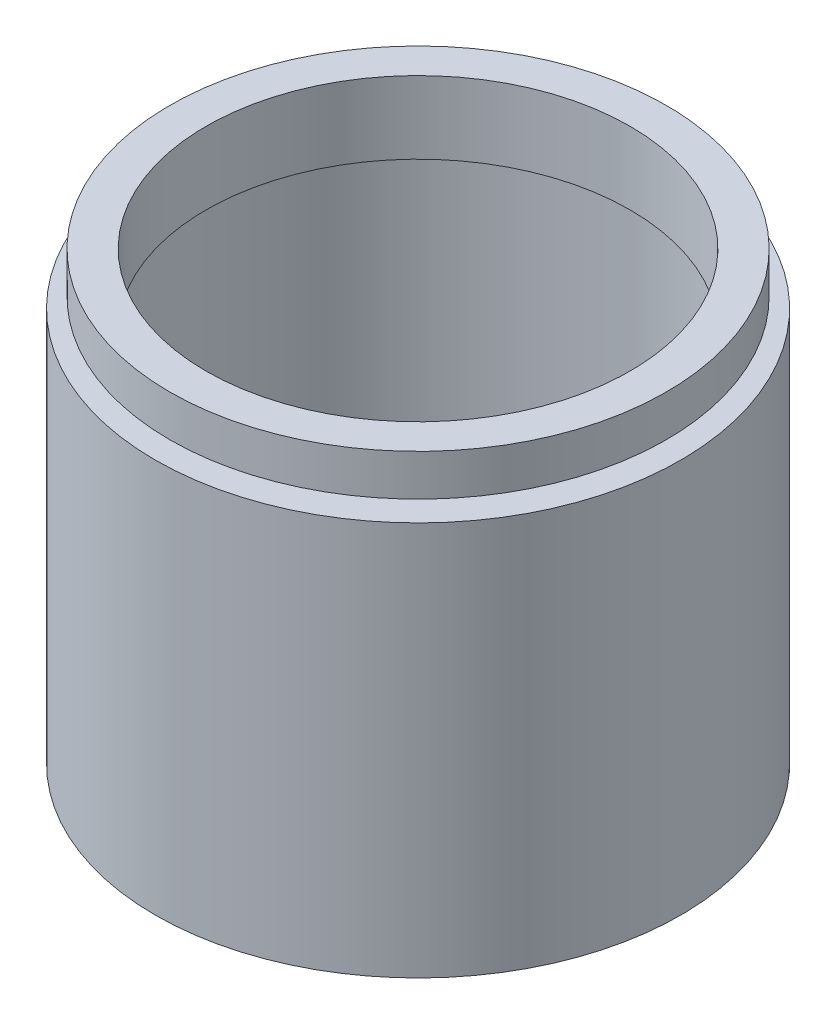
ISO-10303-21;
HEADER;
FILE_DESCRIPTION(('STEP AP214'),'2;1');
FILE_NAME('part.step','',(''),(''),'','','');
FILE_SCHEMA(('AUTOMOTIVE_DESIGN { 1 0 10303 214 1 1 1 1 }'));
ENDSEC;
DATA;
#1=APPLICATION_CONTEXT('core data for automotive mechanical design processes');
#2=APPLICATION_PROTOCOL_DEFINITION('international standard','automotive_design',2000,#1);
#3=PRODUCT_CONTEXT('',#1,'mechanical');
#4=PRODUCT('Part','Part','',(#3));
#5=PRODUCT_RELATED_PRODUCT_CATEGORY('part','',(#4));
#6=PRODUCT_DEFINITION_FORMATION('','',#4);
#7=PRODUCT_DEFINITION_CONTEXT('part definition',#1,'design');
#8=PRODUCT_DEFINITION('design','',#6,#7);
#9=PRODUCT_DEFINITION_SHAPE('','',#8);
#10=(LENGTH_UNIT() NAMED_UNIT(*) SI_UNIT(.MILLI.,.METRE.));
#11=(NAMED_UNIT(*) PLANE_ANGLE_UNIT() SI_UNIT($,.RADIAN.));
#12=(NAMED_UNIT(*) SI_UNIT($,.STERADIAN.) SOLID_ANGLE_UNIT());
#13=UNCERTAINTY_MEASURE_WITH_UNIT(LENGTH_MEASURE(1.E-05),#10,'distance_accuracy_value','');
#14=(GEOMETRIC_REPRESENTATION_CONTEXT(3) GLOBAL_UNCERTAINTY_ASSIGNED_CONTEXT((#13)) GLOBAL_UNIT_ASSIGNED_CONTEXT((#10,
#11,#12)) REPRESENTATION_CONTEXT('',''));
#15=CARTESIAN_POINT('',(0.,0.,0.));
#16=DIRECTION('',(0.,0.,1.));
#17=DIRECTION('',(1.,0.,0.));
#18=AXIS2_PLACEMENT_3D('',#15,#16,#17);
#19=CARTESIAN_POINT('',(25.4,38.1,0.));
#20=DIRECTION('',(0.,-1.,0.));
#21=DIRECTION('',(0.,0.,-1.));
#22=AXIS2_PLACEMENT_3D('',#19,#20,#21);
#23=PLANE('',#22);
#24=CARTESIAN_POINT('',(0.,38.1,0.));
#25=DIRECTION('',(0.,1.,0.));
#26=DIRECTION('',(0.,0.,1.));
#27=AXIS2_PLACEMENT_3D('',#24,#25,#26);
#28=CIRCLE('',#27,22.4999999999999);
#29=CARTESIAN_POINT('',(0.,38.1,22.4999999999999));
#30=VERTEX_POINT('',#29);
#31=EDGE_CURVE('E89',#30,#30,#28,.T.);
#32=ORIENTED_EDGE('',*,*,#31,.F.);
#33=EDGE_LOOP('',(#32));
#34=FACE_BOUND('',#33,.T.);
#35=CARTESIAN_POINT('',(0.,38.1,0.));
#36=DIRECTION('',(0.,1.,0.));
#37=DIRECTION('',(0.,0.,1.));
#38=AXIS2_PLACEMENT_3D('',#35,#36,#37);
#39=CIRCLE('',#38,25.4);
#40=CARTESIAN_POINT('',(0.,38.1,25.4));
#41=VERTEX_POINT('',#40);
#42=EDGE_CURVE('E10',#41,#41,#39,.T.);
#43=ORIENTED_EDGE('',*,*,#42,.T.);
#44=EDGE_LOOP('',(#43));
#45=FACE_BOUND('',#44,.T.);
#46=ADVANCED_FACE('F37',(#34,#45),#23,.F.);
#47=CARTESIAN_POINT('',(0.,161.376166943427,0.));
#48=DIRECTION('',(0.,1.,0.));
#49=DIRECTION('',(0.,0.,1.));
#50=AXIS2_PLACEMENT_3D('',#47,#48,#49);
#51=CYLINDRICAL_SURFACE('',#50,25.4);
#52=ORIENTED_EDGE('',*,*,#42,.F.);
#53=EDGE_LOOP('',(#52));
#54=FACE_BOUND('',#53,.T.);
#55=CARTESIAN_POINT('',(0.,0.,0.));
#56=DIRECTION('',(0.,1.,0.));
#57=DIRECTION('',(0.,0.,1.));
#58=AXIS2_PLACEMENT_3D('',#55,#56,#57);
#59=CIRCLE('',#58,25.4);
#60=CARTESIAN_POINT('',(0.,0.,25.4));
#61=VERTEX_POINT('',#60);
#62=EDGE_CURVE('E43',#61,#61,#59,.T.);
#63=ORIENTED_EDGE('',*,*,#62,.T.);
#64=EDGE_LOOP('',(#63));
#65=FACE_BOUND('',#64,.T.);
#66=ADVANCED_FACE('F96',(#54,#65),#51,.T.);
#67=CARTESIAN_POINT('',(25.4,0.,0.));
#68=DIRECTION('',(0.,1.,0.));
#69=DIRECTION('',(0.,0.,1.));
#70=AXIS2_PLACEMENT_3D('',#67,#68,#69);
#71=PLANE('',#70);
#72=ORIENTED_EDGE('',*,*,#62,.F.);
#73=EDGE_LOOP('',(#72));
#74=FACE_BOUND('',#73,.T.);
#75=CARTESIAN_POINT('',(0.,0.,0.));
#76=DIRECTION('',(0.,1.,0.));
#77=DIRECTION('',(0.,0.,1.));
#78=AXIS2_PLACEMENT_3D('',#75,#76,#77);
#79=CIRCLE('',#78,22.5);
#80=CARTESIAN_POINT('',(0.,0.,22.5));
#81=VERTEX_POINT('',#80);
#82=EDGE_CURVE('E47',#81,#81,#79,.T.);
#83=ORIENTED_EDGE('',*,*,#82,.T.);
#84=EDGE_LOOP('',(#83));
#85=FACE_BOUND('',#84,.T.);
#86=ADVANCED_FACE('F100',(#74,#85),#71,.F.);
#87=CARTESIAN_POINT('',(0.,161.376166943427,0.));
#88=DIRECTION('',(0.,1.,0.));
#89=DIRECTION('',(0.,0.,1.));
#90=AXIS2_PLACEMENT_3D('',#87,#88,#89);
#91=CYLINDRICAL_SURFACE('',#90,22.5);
#92=ORIENTED_EDGE('',*,*,#82,.F.);
#93=EDGE_LOOP('',(#92));
#94=FACE_BOUND('',#93,.T.);
#95=CARTESIAN_POINT('',(0.,5.49999999999998,0.));
#96=DIRECTION('',(0.,1.,0.));
#97=DIRECTION('',(0.,0.,1.));
#98=AXIS2_PLACEMENT_3D('',#95,#96,#97);
#99=CIRCLE('',#98,22.5);
#100=CARTESIAN_POINT('',(0.,5.49999999999998,22.5));
#101=VERTEX_POINT('',#100);
#102=EDGE_CURVE('E51',#101,#101,#99,.T.);
#103=ORIENTED_EDGE('',*,*,#102,.T.);
#104=EDGE_LOOP('',(#103));
#105=FACE_BOUND('',#104,.T.);
#106=ADVANCED_FACE('F105',(#94,#105),#91,.F.);
#107=CARTESIAN_POINT('',(22.5,5.49999999999999,0.));
#108=DIRECTION('',(0.,-1.,0.));
#109=DIRECTION('',(0.,0.,-1.));
#110=AXIS2_PLACEMENT_3D('',#107,#108,#109);
#111=PLANE('',#110);
#112=ORIENTED_EDGE('',*,*,#102,.F.);
#113=EDGE_LOOP('',(#112));
#114=FACE_BOUND('',#113,.T.);
#115=CARTESIAN_POINT('',(0.,5.49999999999998,0.));
#116=DIRECTION('',(0.,1.,0.));
#117=DIRECTION('',(0.,0.,1.));
#118=AXIS2_PLACEMENT_3D('',#115,#116,#117);
#119=CIRCLE('',#118,23.4999999999999);
#120=CARTESIAN_POINT('',(0.,5.49999999999998,23.4999999999999));
#121=VERTEX_POINT('',#120);
#122=EDGE_CURVE('E56',#121,#121,#119,.T.);
#123=ORIENTED_EDGE('',*,*,#122,.T.);
#124=EDGE_LOOP('',(#123));
#125=FACE_BOUND('',#124,.T.);
#126=ADVANCED_FACE('F111',(#114,#125),#111,.F.);
#127=CARTESIAN_POINT('',(0.,161.376166943427,0.));
#128=DIRECTION('',(0.,1.,0.));
#129=DIRECTION('',(0.,0.,1.));
#130=AXIS2_PLACEMENT_3D('',#127,#128,#129);
#131=CYLINDRICAL_SURFACE('',#130,23.4999999999999);
#132=ORIENTED_EDGE('',*,*,#122,.F.);
#133=EDGE_LOOP('',(#132));
#134=FACE_BOUND('',#133,.T.);
#135=CARTESIAN_POINT('',(0.,6.49999999999998,0.));
#136=DIRECTION('',(0.,1.,0.));
#137=DIRECTION('',(0.,0.,1.));
#138=AXIS2_PLACEMENT_3D('',#135,#136,#137);
#139=CIRCLE('',#138,23.4999999999999);
#140=CARTESIAN_POINT('',(0.,6.49999999999998,23.4999999999999));
#141=VERTEX_POINT('',#140);
#142=EDGE_CURVE('E59',#141,#141,#139,.T.);
#143=ORIENTED_EDGE('',*,*,#142,.T.);
#144=EDGE_LOOP('',(#143));
#145=FACE_BOUND('',#144,.T.);
#146=ADVANCED_FACE('F115',(#134,#145),#131,.F.);
#147=CARTESIAN_POINT('',(23.4999999999999,6.49999999999999,0.));
#148=DIRECTION('',(0.,1.,0.));
#149=DIRECTION('',(0.,0.,1.));
#150=AXIS2_PLACEMENT_3D('',#147,#148,#149);
#151=PLANE('',#150);
#152=ORIENTED_EDGE('',*,*,#142,.F.);
#153=EDGE_LOOP('',(#152));
#154=FACE_BOUND('',#153,.T.);
#155=CARTESIAN_POINT('',(0.,6.49999999999998,0.));
#156=DIRECTION('',(0.,1.,0.));
#157=DIRECTION('',(0.,0.,1.));
#158=AXIS2_PLACEMENT_3D('',#155,#156,#157);
#159=CIRCLE('',#158,22.5);
#160=CARTESIAN_POINT('',(0.,6.49999999999998,22.5));
#161=VERTEX_POINT('',#160);
#162=EDGE_CURVE('E62',#161,#161,#159,.T.);
#163=ORIENTED_EDGE('',*,*,#162,.T.);
#164=EDGE_LOOP('',(#163));
#165=FACE_BOUND('',#164,.T.);
#166=ADVANCED_FACE('F119',(#154,#165),#151,.F.);
#167=CARTESIAN_POINT('',(0.,161.376166943427,0.));
#168=DIRECTION('',(0.,1.,0.));
#169=DIRECTION('',(0.,0.,1.));
#170=AXIS2_PLACEMENT_3D('',#167,#168,#169);
#171=CYLINDRICAL_SURFACE('',#170,22.5);
#172=ORIENTED_EDGE('',*,*,#162,.F.);
#173=EDGE_LOOP('',(#172));
#174=FACE_BOUND('',#173,.T.);
#175=CARTESIAN_POINT('',(0.,35.1,0.));
#176=DIRECTION('',(0.,1.,0.));
#177=DIRECTION('',(0.,0.,1.));
#178=AXIS2_PLACEMENT_3D('',#175,#176,#177);
#179=CIRCLE('',#178,22.5);
#180=CARTESIAN_POINT('',(0.,35.1,22.5));
#181=VERTEX_POINT('',#180);
#182=EDGE_CURVE('E65',#181,#181,#179,.T.);
#183=ORIENTED_EDGE('',*,*,#182,.T.);
#184=EDGE_LOOP('',(#183));
#185=FACE_BOUND('',#184,.T.);
#186=ADVANCED_FACE('F123',(#174,#185),#171,.F.);
#187=CARTESIAN_POINT('',(22.5,35.1,0.));
#188=DIRECTION('',(0.,-1.,0.));
#189=DIRECTION('',(0.,0.,-1.));
#190=AXIS2_PLACEMENT_3D('',#187,#188,#189);
#191=PLANE('',#190);
#192=ORIENTED_EDGE('',*,*,#182,.F.);
#193=EDGE_LOOP('',(#192));
#194=FACE_BOUND('',#193,.T.);
#195=CARTESIAN_POINT('',(0.,35.1,0.));
#196=DIRECTION('',(0.,1.,0.));
#197=DIRECTION('',(0.,0.,1.));
#198=AXIS2_PLACEMENT_3D('',#195,#196,#197);
#199=CIRCLE('',#198,24.);
#200=CARTESIAN_POINT('',(0.,35.1,24.));
#201=VERTEX_POINT('',#200);
#202=EDGE_CURVE('E68',#201,#201,#199,.T.);
#203=ORIENTED_EDGE('',*,*,#202,.T.);
#204=EDGE_LOOP('',(#203));
#205=FACE_BOUND('',#204,.T.);
#206=ADVANCED_FACE('F127',(#194,#205),#191,.F.);
#207=CARTESIAN_POINT('',(0.,161.376166943427,0.));
#208=DIRECTION('',(0.,1.,0.));
#209=DIRECTION('',(0.,0.,1.));
#210=AXIS2_PLACEMENT_3D('',#207,#208,#209);
#211=CYLINDRICAL_SURFACE('',#210,24.);
#212=ORIENTED_EDGE('',*,*,#202,.F.);
#213=EDGE_LOOP('',(#212));
#214=FACE_BOUND('',#213,.T.);
#215=CARTESIAN_POINT('',(0.,36.1,0.));
#216=DIRECTION('',(0.,1.,0.));
#217=DIRECTION('',(0.,0.,1.));
#218=AXIS2_PLACEMENT_3D('',#215,#216,#217);
#219=CIRCLE('',#218,24.);
#220=CARTESIAN_POINT('',(0.,36.1,24.));
#221=VERTEX_POINT('',#220);
#222=EDGE_CURVE('E71',#221,#221,#219,.T.);
#223=ORIENTED_EDGE('',*,*,#222,.T.);
#224=EDGE_LOOP('',(#223));
#225=FACE_BOUND('',#224,.T.);
#226=ADVANCED_FACE('F131',(#214,#225),#211,.F.);
#227=CARTESIAN_POINT('',(24.,36.1,0.));
#228=DIRECTION('',(0.,1.,0.));
#229=DIRECTION('',(0.,0.,1.));
#230=AXIS2_PLACEMENT_3D('',#227,#228,#229);
#231=PLANE('',#230);
#232=ORIENTED_EDGE('',*,*,#222,.F.);
#233=EDGE_LOOP('',(#232));
#234=FACE_BOUND('',#233,.T.);
#235=CARTESIAN_POINT('',(0.,36.1,0.));
#236=DIRECTION('',(0.,1.,0.));
#237=DIRECTION('',(0.,0.,1.));
#238=AXIS2_PLACEMENT_3D('',#235,#236,#237);
#239=CIRCLE('',#238,20.5);
#240=CARTESIAN_POINT('',(0.,36.1,20.5));
#241=VERTEX_POINT('',#240);
#242=EDGE_CURVE('E74',#241,#241,#239,.T.);
#243=ORIENTED_EDGE('',*,*,#242,.T.);
#244=EDGE_LOOP('',(#243));
#245=FACE_BOUND('',#244,.T.);
#246=ADVANCED_FACE('F135',(#234,#245),#231,.F.);
#247=CARTESIAN_POINT('',(0.,161.376166943427,0.));
#248=DIRECTION('',(0.,1.,0.));
#249=DIRECTION('',(0.,0.,1.));
#250=AXIS2_PLACEMENT_3D('',#247,#248,#249);
#251=CYLINDRICAL_SURFACE('',#250,20.5);
#252=ORIENTED_EDGE('',*,*,#242,.F.);
#253=EDGE_LOOP('',(#252));
#254=FACE_BOUND('',#253,.T.);
#255=CARTESIAN_POINT('',(0.,43.1,0.));
#256=DIRECTION('',(0.,1.,0.));
#257=DIRECTION('',(0.,0.,1.));
#258=AXIS2_PLACEMENT_3D('',#255,#256,#257);
#259=CIRCLE('',#258,20.5);
#260=CARTESIAN_POINT('',(0.,43.1,20.5));
#261=VERTEX_POINT('',#260);
#262=EDGE_CURVE('E77',#261,#261,#259,.T.);
#263=ORIENTED_EDGE('',*,*,#262,.T.);
#264=EDGE_LOOP('',(#263));
#265=FACE_BOUND('',#264,.T.);
#266=ADVANCED_FACE('F139',(#254,#265),#251,.F.);
#267=CARTESIAN_POINT('',(20.5,43.1,0.));
#268=DIRECTION('',(0.,-1.,0.));
#269=DIRECTION('',(0.,0.,-1.));
#270=AXIS2_PLACEMENT_3D('',#267,#268,#269);
#271=PLANE('',#270);
#272=ORIENTED_EDGE('',*,*,#262,.F.);
#273=EDGE_LOOP('',(#272));
#274=FACE_BOUND('',#273,.T.);
#275=CARTESIAN_POINT('',(0.,43.1,0.));
#276=DIRECTION('',(0.,1.,0.));
#277=DIRECTION('',(0.,0.,1.));
#278=AXIS2_PLACEMENT_3D('',#275,#276,#277);
#279=CIRCLE('',#278,24.);
#280=CARTESIAN_POINT('',(0.,43.1,24.));
#281=VERTEX_POINT('',#280);
#282=EDGE_CURVE('E80',#281,#281,#279,.T.);
#283=ORIENTED_EDGE('',*,*,#282,.T.);
#284=EDGE_LOOP('',(#283));
#285=FACE_BOUND('',#284,.T.);
#286=ADVANCED_FACE('F143',(#274,#285),#271,.F.);
#287=CARTESIAN_POINT('',(0.,161.376166943427,0.));
#288=DIRECTION('',(0.,1.,0.));
#289=DIRECTION('',(0.,0.,1.));
#290=AXIS2_PLACEMENT_3D('',#287,#288,#289);
#291=CYLINDRICAL_SURFACE('',#290,24.);
#292=ORIENTED_EDGE('',*,*,#282,.F.);
#293=EDGE_LOOP('',(#292));
#294=FACE_BOUND('',#293,.T.);
#295=CARTESIAN_POINT('',(0.,39.1,0.));
#296=DIRECTION('',(0.,1.,0.));
#297=DIRECTION('',(0.,0.,1.));
#298=AXIS2_PLACEMENT_3D('',#295,#296,#297);
#299=CIRCLE('',#298,24.);
#300=CARTESIAN_POINT('',(0.,39.1,24.));
#301=VERTEX_POINT('',#300);
#302=EDGE_CURVE('E83',#301,#301,#299,.T.);
#303=ORIENTED_EDGE('',*,*,#302,.T.);
#304=EDGE_LOOP('',(#303));
#305=FACE_BOUND('',#304,.T.);
#306=ADVANCED_FACE('F147',(#294,#305),#291,.T.);
#307=CARTESIAN_POINT('',(24.,39.1,0.));
#308=DIRECTION('',(0.,1.,0.));
#309=DIRECTION('',(0.,0.,1.));
#310=AXIS2_PLACEMENT_3D('',#307,#308,#309);
#311=PLANE('',#310);
#312=ORIENTED_EDGE('',*,*,#302,.F.);
#313=EDGE_LOOP('',(#312));
#314=FACE_BOUND('',#313,.T.);
#315=CARTESIAN_POINT('',(0.,39.1,0.));
#316=DIRECTION('',(0.,1.,0.));
#317=DIRECTION('',(0.,0.,1.));
#318=AXIS2_PLACEMENT_3D('',#315,#316,#317);
#319=CIRCLE('',#318,22.4999999999999);
#320=CARTESIAN_POINT('',(0.,39.1,22.4999999999999));
#321=VERTEX_POINT('',#320);
#322=EDGE_CURVE('E86',#321,#321,#319,.T.);
#323=ORIENTED_EDGE('',*,*,#322,.T.);
#324=EDGE_LOOP('',(#323));
#325=FACE_BOUND('',#324,.T.);
#326=ADVANCED_FACE('F151',(#314,#325),#311,.F.);
#327=CARTESIAN_POINT('',(0.,161.376166943427,0.));
#328=DIRECTION('',(0.,1.,0.));
#329=DIRECTION('',(0.,0.,1.));
#330=AXIS2_PLACEMENT_3D('',#327,#328,#329);
#331=CYLINDRICAL_SURFACE('',#330,22.4999999999999);
#332=ORIENTED_EDGE('',*,*,#322,.F.);
#333=EDGE_LOOP('',(#332));
#334=FACE_BOUND('',#333,.T.);
#335=ORIENTED_EDGE('',*,*,#31,.T.);
#336=EDGE_LOOP('',(#335));
#337=FACE_BOUND('',#336,.T.);
#338=ADVANCED_FACE('F93',(#334,#337),#331,.T.);
#339=CLOSED_SHELL('',(#46,#66,#86,#106,#126,#146,#166,#186,#206,#226,#246,#266,#286,#306,#326,#338));
#340=MANIFOLD_SOLID_BREP('B2',#339);
#341=ADVANCED_BREP_SHAPE_REPRESENTATION('',(#18,#340),#14);
#342=SHAPE_DEFINITION_REPRESENTATION(#9,#341);
ENDSEC;
END-ISO-10303-21;
